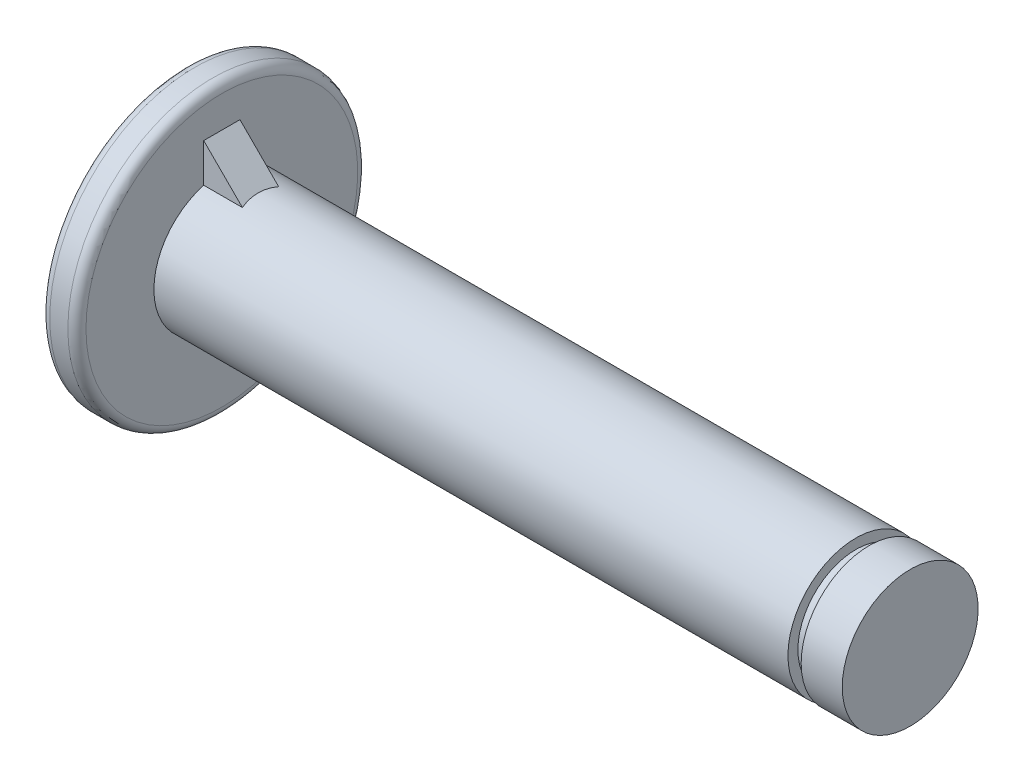
ISO-10303-21;
HEADER;
FILE_DESCRIPTION(('STEP AP214'),'2;1');
FILE_NAME('part.step','',(''),(''),'','','');
FILE_SCHEMA(('AUTOMOTIVE_DESIGN { 1 0 10303 214 1 1 1 1 }'));
ENDSEC;
DATA;
#1=APPLICATION_CONTEXT('core data for automotive mechanical design processes');
#2=APPLICATION_PROTOCOL_DEFINITION('international standard','automotive_design',2000,#1);
#3=PRODUCT_CONTEXT('',#1,'mechanical');
#4=PRODUCT('Part','Part','',(#3));
#5=PRODUCT_RELATED_PRODUCT_CATEGORY('part','',(#4));
#6=PRODUCT_DEFINITION_FORMATION('','',#4);
#7=PRODUCT_DEFINITION_CONTEXT('part definition',#1,'design');
#8=PRODUCT_DEFINITION('design','',#6,#7);
#9=PRODUCT_DEFINITION_SHAPE('','',#8);
#10=(LENGTH_UNIT() NAMED_UNIT(*) SI_UNIT(.MILLI.,.METRE.));
#11=(NAMED_UNIT(*) PLANE_ANGLE_UNIT() SI_UNIT($,.RADIAN.));
#12=(NAMED_UNIT(*) SI_UNIT($,.STERADIAN.) SOLID_ANGLE_UNIT());
#13=UNCERTAINTY_MEASURE_WITH_UNIT(LENGTH_MEASURE(1.E-05),#10,'distance_accuracy_value','');
#14=(GEOMETRIC_REPRESENTATION_CONTEXT(3) GLOBAL_UNCERTAINTY_ASSIGNED_CONTEXT((#13)) GLOBAL_UNIT_ASSIGNED_CONTEXT((#10,
#11,#12)) REPRESENTATION_CONTEXT('',''));
#15=CARTESIAN_POINT('',(0.,0.,0.));
#16=DIRECTION('',(0.,0.,1.));
#17=DIRECTION('',(1.,0.,0.));
#18=AXIS2_PLACEMENT_3D('',#15,#16,#17);
#19=CARTESIAN_POINT('',(0.,0.,0.));
#20=DIRECTION('',(-1.,0.,0.));
#21=DIRECTION('',(0.,0.,1.));
#22=AXIS2_PLACEMENT_3D('',#19,#20,#21);
#23=CYLINDRICAL_SURFACE('',#22,8.);
#24=CARTESIAN_POINT('',(1.5,0.,0.));
#25=DIRECTION('',(-1.,0.,0.));
#26=DIRECTION('',(0.,0.,1.));
#27=AXIS2_PLACEMENT_3D('',#24,#25,#26);
#28=CIRCLE('',#27,8.);
#29=CARTESIAN_POINT('',(1.5,0.,8.));
#30=VERTEX_POINT('',#29);
#31=EDGE_CURVE('E124',#30,#30,#28,.T.);
#32=ORIENTED_EDGE('',*,*,#31,.T.);
#33=EDGE_LOOP('',(#32));
#34=FACE_BOUND('',#33,.T.);
#35=CARTESIAN_POINT('',(0.5,0.,0.));
#36=DIRECTION('',(1.,0.,0.));
#37=DIRECTION('',(0.,0.,-1.));
#38=AXIS2_PLACEMENT_3D('',#35,#36,#37);
#39=CIRCLE('',#38,8.);
#40=CARTESIAN_POINT('',(0.5,0.,-8.));
#41=VERTEX_POINT('',#40);
#42=EDGE_CURVE('E121',#41,#41,#39,.T.);
#43=ORIENTED_EDGE('',*,*,#42,.T.);
#44=EDGE_LOOP('',(#43));
#45=FACE_BOUND('',#44,.T.);
#46=ADVANCED_FACE('F43',(#34,#45),#23,.T.);
#47=CARTESIAN_POINT('',(0.,8.,0.));
#48=DIRECTION('',(1.,0.,0.));
#49=DIRECTION('',(0.,0.,-1.));
#50=AXIS2_PLACEMENT_3D('',#47,#48,#49);
#51=PLANE('',#50);
#52=CARTESIAN_POINT('',(0.,0.,0.));
#53=DIRECTION('',(1.,0.,0.));
#54=DIRECTION('',(0.,0.,-1.));
#55=AXIS2_PLACEMENT_3D('',#52,#53,#54);
#56=CIRCLE('',#55,7.5);
#57=CARTESIAN_POINT('',(0.,0.,-7.5));
#58=VERTEX_POINT('',#57);
#59=EDGE_CURVE('E11',#58,#58,#56,.F.);
#60=ORIENTED_EDGE('',*,*,#59,.T.);
#61=EDGE_LOOP('',(#60));
#62=FACE_BOUND('',#61,.T.);
#63=ADVANCED_FACE('F142',(#62),#51,.F.);
#64=CARTESIAN_POINT('',(40.,0.,0.));
#65=DIRECTION('',(-1.,0.,0.));
#66=DIRECTION('',(0.,0.,1.));
#67=AXIS2_PLACEMENT_3D('',#64,#65,#66);
#68=PLANE('',#67);
#69=CARTESIAN_POINT('',(40.,0.,0.));
#70=DIRECTION('',(-1.,0.,0.));
#71=DIRECTION('',(0.,0.,1.));
#72=AXIS2_PLACEMENT_3D('',#69,#70,#71);
#73=CIRCLE('',#72,3.75);
#74=CARTESIAN_POINT('',(40.,0.,3.75));
#75=VERTEX_POINT('',#74);
#76=EDGE_CURVE('E118',#75,#75,#73,.T.);
#77=ORIENTED_EDGE('',*,*,#76,.F.);
#78=EDGE_LOOP('',(#77));
#79=FACE_BOUND('',#78,.T.);
#80=ADVANCED_FACE('F148',(#79),#68,.F.);
#81=CARTESIAN_POINT('',(0.,0.,0.));
#82=DIRECTION('',(-1.,0.,0.));
#83=DIRECTION('',(0.,0.,1.));
#84=AXIS2_PLACEMENT_3D('',#81,#82,#83);
#85=CYLINDRICAL_SURFACE('',#84,3.75);
#86=CARTESIAN_POINT('',(37.73,0.,0.));
#87=DIRECTION('',(-1.,0.,0.));
#88=DIRECTION('',(0.,0.,1.));
#89=AXIS2_PLACEMENT_3D('',#86,#87,#88);
#90=CIRCLE('',#89,3.75);
#91=CARTESIAN_POINT('',(37.73,0.,3.75));
#92=VERTEX_POINT('',#91);
#93=EDGE_CURVE('E115',#92,#92,#90,.T.);
#94=ORIENTED_EDGE('',*,*,#93,.F.);
#95=EDGE_LOOP('',(#94));
#96=FACE_BOUND('',#95,.T.);
#97=ORIENTED_EDGE('',*,*,#76,.T.);
#98=EDGE_LOOP('',(#97));
#99=FACE_BOUND('',#98,.T.);
#100=ADVANCED_FACE('F155',(#96,#99),#85,.T.);
#101=CARTESIAN_POINT('',(37.73,3.2,0.));
#102=DIRECTION('',(1.,0.,0.));
#103=DIRECTION('',(0.,0.,-1.));
#104=AXIS2_PLACEMENT_3D('',#101,#102,#103);
#105=PLANE('',#104);
#106=CARTESIAN_POINT('',(37.73,0.,0.));
#107=DIRECTION('',(-1.,0.,0.));
#108=DIRECTION('',(0.,0.,1.));
#109=AXIS2_PLACEMENT_3D('',#106,#107,#108);
#110=CIRCLE('',#109,3.2);
#111=CARTESIAN_POINT('',(37.73,0.,3.2));
#112=VERTEX_POINT('',#111);
#113=EDGE_CURVE('E112',#112,#112,#110,.T.);
#114=ORIENTED_EDGE('',*,*,#113,.F.);
#115=EDGE_LOOP('',(#114));
#116=FACE_BOUND('',#115,.T.);
#117=ORIENTED_EDGE('',*,*,#93,.T.);
#118=EDGE_LOOP('',(#117));
#119=FACE_BOUND('',#118,.T.);
#120=ADVANCED_FACE('F159',(#116,#119),#105,.F.);
#121=CARTESIAN_POINT('',(0.,0.,0.));
#122=DIRECTION('',(-1.,0.,0.));
#123=DIRECTION('',(0.,0.,1.));
#124=AXIS2_PLACEMENT_3D('',#121,#122,#123);
#125=CYLINDRICAL_SURFACE('',#124,3.2);
#126=CARTESIAN_POINT('',(37.,0.,0.));
#127=DIRECTION('',(-1.,0.,0.));
#128=DIRECTION('',(0.,0.,1.));
#129=AXIS2_PLACEMENT_3D('',#126,#127,#128);
#130=CIRCLE('',#129,3.2);
#131=CARTESIAN_POINT('',(37.,0.,3.2));
#132=VERTEX_POINT('',#131);
#133=EDGE_CURVE('E109',#132,#132,#130,.T.);
#134=ORIENTED_EDGE('',*,*,#133,.F.);
#135=EDGE_LOOP('',(#134));
#136=FACE_BOUND('',#135,.T.);
#137=ORIENTED_EDGE('',*,*,#113,.T.);
#138=EDGE_LOOP('',(#137));
#139=FACE_BOUND('',#138,.T.);
#140=ADVANCED_FACE('F163',(#136,#139),#125,.T.);
#141=CARTESIAN_POINT('',(37.,3.75,0.));
#142=DIRECTION('',(-1.,0.,0.));
#143=DIRECTION('',(0.,0.,1.));
#144=AXIS2_PLACEMENT_3D('',#141,#142,#143);
#145=PLANE('',#144);
#146=CARTESIAN_POINT('',(37.,0.,0.));
#147=DIRECTION('',(-1.,0.,0.));
#148=DIRECTION('',(0.,0.,1.));
#149=AXIS2_PLACEMENT_3D('',#146,#147,#148);
#150=CIRCLE('',#149,3.75);
#151=CARTESIAN_POINT('',(37.,0.,3.75));
#152=VERTEX_POINT('',#151);
#153=EDGE_CURVE('E106',#152,#152,#150,.T.);
#154=ORIENTED_EDGE('',*,*,#153,.F.);
#155=EDGE_LOOP('',(#154));
#156=FACE_BOUND('',#155,.T.);
#157=ORIENTED_EDGE('',*,*,#133,.T.);
#158=EDGE_LOOP('',(#157));
#159=FACE_BOUND('',#158,.T.);
#160=ADVANCED_FACE('F167',(#156,#159),#145,.F.);
#161=CARTESIAN_POINT('',(0.,0.,0.));
#162=DIRECTION('',(-1.,0.,0.));
#163=DIRECTION('',(0.,0.,1.));
#164=AXIS2_PLACEMENT_3D('',#161,#162,#163);
#165=CYLINDRICAL_SURFACE('',#164,3.75);
#166=CARTESIAN_POINT('',(7.74999999999998,0.,0.));
#167=DIRECTION('',(0.707106781186548,0.707106781186547,0.));
#168=DIRECTION('',(-0.707106781186547,0.707106781186548,0.));
#169=AXIS2_PLACEMENT_3D('',#166,#167,#168);
#170=ELLIPSE('',#169,5.3033008588991,3.75);
#171=CARTESIAN_POINT('',(4.13579192629976,3.61420807370024,-1.));
#172=VERTEX_POINT('',#171);
#173=CARTESIAN_POINT('',(4.13579192629976,3.61420807370024,1.));
#174=VERTEX_POINT('',#173);
#175=EDGE_CURVE('E58',#172,#174,#170,.T.);
#176=ORIENTED_EDGE('',*,*,#175,.T.);
#177=DIRECTION('',(-1.,0.,0.));
#178=VECTOR('',#177,1.);
#179=CARTESIAN_POINT('',(0.,3.61420807370024,1.));
#180=LINE('',#179,#178);
#181=CARTESIAN_POINT('',(2.,3.61420807370024,1.));
#182=VERTEX_POINT('',#181);
#183=EDGE_CURVE('E88',#174,#182,#180,.T.);
#184=ORIENTED_EDGE('',*,*,#183,.T.);
#185=CARTESIAN_POINT('',(2.,0.,0.));
#186=DIRECTION('',(-1.,0.,0.));
#187=DIRECTION('',(0.,0.,1.));
#188=AXIS2_PLACEMENT_3D('',#185,#186,#187);
#189=CIRCLE('',#188,3.75);
#190=CARTESIAN_POINT('',(2.,3.61420807370024,-1.));
#191=VERTEX_POINT('',#190);
#192=EDGE_CURVE('E104',#191,#182,#189,.T.);
#193=ORIENTED_EDGE('',*,*,#192,.F.);
#194=DIRECTION('',(-1.,0.,0.));
#195=VECTOR('',#194,1.);
#196=CARTESIAN_POINT('',(0.,3.61420807370024,-1.));
#197=LINE('',#196,#195);
#198=EDGE_CURVE('E63',#172,#191,#197,.T.);
#199=ORIENTED_EDGE('',*,*,#198,.F.);
#200=EDGE_LOOP('',(#176,#184,#193,#199));
#201=FACE_BOUND('',#200,.T.);
#202=ORIENTED_EDGE('',*,*,#153,.T.);
#203=EDGE_LOOP('',(#202));
#204=FACE_BOUND('',#203,.T.);
#205=ADVANCED_FACE('F137',(#201,#204),#165,.T.);
#206=CARTESIAN_POINT('',(2.,3.75,0.));
#207=DIRECTION('',(-1.,0.,0.));
#208=DIRECTION('',(0.,0.,1.));
#209=AXIS2_PLACEMENT_3D('',#206,#207,#208);
#210=PLANE('',#209);
#211=ORIENTED_EDGE('',*,*,#192,.T.);
#212=DIRECTION('',(0.,1.,0.));
#213=VECTOR('',#212,1.);
#214=CARTESIAN_POINT('',(2.,3.75,1.));
#215=LINE('',#214,#213);
#216=CARTESIAN_POINT('',(2.,5.75,1.));
#217=VERTEX_POINT('',#216);
#218=EDGE_CURVE('E83',#182,#217,#215,.T.);
#219=ORIENTED_EDGE('',*,*,#218,.T.);
#220=DIRECTION('',(0.,0.,-1.));
#221=VECTOR('',#220,1.);
#222=CARTESIAN_POINT('',(2.,5.75,0.));
#223=LINE('',#222,#221);
#224=CARTESIAN_POINT('',(2.,5.75,-1.));
#225=VERTEX_POINT('',#224);
#226=EDGE_CURVE('E77',#217,#225,#223,.T.);
#227=ORIENTED_EDGE('',*,*,#226,.T.);
#228=DIRECTION('',(0.,1.,0.));
#229=VECTOR('',#228,1.);
#230=CARTESIAN_POINT('',(2.,3.75,-1.));
#231=LINE('',#230,#229);
#232=EDGE_CURVE('E81',#191,#225,#231,.T.);
#233=ORIENTED_EDGE('',*,*,#232,.F.);
#234=EDGE_LOOP('',(#211,#219,#227,#233));
#235=FACE_BOUND('',#234,.T.);
#236=CARTESIAN_POINT('',(2.,0.,0.));
#237=DIRECTION('',(-1.,0.,0.));
#238=DIRECTION('',(0.,0.,1.));
#239=AXIS2_PLACEMENT_3D('',#236,#237,#238);
#240=CIRCLE('',#239,7.5);
#241=CARTESIAN_POINT('',(2.,0.,7.5));
#242=VERTEX_POINT('',#241);
#243=EDGE_CURVE('E51',#242,#242,#240,.F.);
#244=ORIENTED_EDGE('',*,*,#243,.T.);
#245=EDGE_LOOP('',(#244));
#246=FACE_BOUND('',#245,.T.);
#247=ADVANCED_FACE('F79',(#235,#246),#210,.F.);
#248=CARTESIAN_POINT('',(1.5,0.,0.));
#249=DIRECTION('',(-1.,0.,0.));
#250=DIRECTION('',(0.,0.,1.));
#251=AXIS2_PLACEMENT_3D('',#248,#249,#250);
#252=TOROIDAL_SURFACE('',#251,7.5,0.5);
#253=ORIENTED_EDGE('',*,*,#31,.F.);
#254=EDGE_LOOP('',(#253));
#255=FACE_BOUND('',#254,.T.);
#256=ORIENTED_EDGE('',*,*,#243,.F.);
#257=EDGE_LOOP('',(#256));
#258=FACE_BOUND('',#257,.T.);
#259=ADVANCED_FACE('F129',(#255,#258),#252,.T.);
#260=CARTESIAN_POINT('',(0.5,0.,0.));
#261=DIRECTION('',(1.,0.,0.));
#262=DIRECTION('',(0.,0.,-1.));
#263=AXIS2_PLACEMENT_3D('',#260,#261,#262);
#264=TOROIDAL_SURFACE('',#263,7.5,0.5);
#265=ORIENTED_EDGE('',*,*,#59,.F.);
#266=EDGE_LOOP('',(#265));
#267=FACE_BOUND('',#266,.T.);
#268=ORIENTED_EDGE('',*,*,#42,.F.);
#269=EDGE_LOOP('',(#268));
#270=FACE_BOUND('',#269,.T.);
#271=ADVANCED_FACE('F45',(#267,#270),#264,.T.);
#272=CARTESIAN_POINT('',(4.,3.75,0.));
#273=DIRECTION('',(0.707106781186548,0.707106781186547,0.));
#274=DIRECTION('',(-0.707106781186547,0.707106781186548,0.));
#275=AXIS2_PLACEMENT_3D('',#272,#273,#274);
#276=PLANE('',#275);
#277=ORIENTED_EDGE('',*,*,#175,.F.);
#278=DIRECTION('',(-0.707106781186547,0.707106781186548,0.));
#279=VECTOR('',#278,1.);
#280=CARTESIAN_POINT('',(4.,3.75,-1.));
#281=LINE('',#280,#279);
#282=EDGE_CURVE('E93',#172,#225,#281,.T.);
#283=ORIENTED_EDGE('',*,*,#282,.T.);
#284=ORIENTED_EDGE('',*,*,#226,.F.);
#285=DIRECTION('',(-0.707106781186547,0.707106781186548,0.));
#286=VECTOR('',#285,1.);
#287=CARTESIAN_POINT('',(4.,3.75,1.));
#288=LINE('',#287,#286);
#289=EDGE_CURVE('E94',#174,#217,#288,.T.);
#290=ORIENTED_EDGE('',*,*,#289,.F.);
#291=EDGE_LOOP('',(#277,#283,#284,#290));
#292=FACE_BOUND('',#291,.T.);
#293=ADVANCED_FACE('F96',(#292),#276,.T.);
#294=CARTESIAN_POINT('',(20.,0.,1.));
#295=DIRECTION('',(0.,0.,1.));
#296=DIRECTION('',(1.,0.,0.));
#297=AXIS2_PLACEMENT_3D('',#294,#295,#296);
#298=PLANE('',#297);
#299=ORIENTED_EDGE('',*,*,#289,.T.);
#300=ORIENTED_EDGE('',*,*,#218,.F.);
#301=ORIENTED_EDGE('',*,*,#183,.F.);
#302=EDGE_LOOP('',(#299,#300,#301));
#303=FACE_BOUND('',#302,.T.);
#304=ADVANCED_FACE('F175',(#303),#298,.T.);
#305=CARTESIAN_POINT('',(20.,0.,-1.));
#306=DIRECTION('',(0.,0.,1.));
#307=DIRECTION('',(1.,0.,0.));
#308=AXIS2_PLACEMENT_3D('',#305,#306,#307);
#309=PLANE('',#308);
#310=ORIENTED_EDGE('',*,*,#282,.F.);
#311=ORIENTED_EDGE('',*,*,#198,.T.);
#312=ORIENTED_EDGE('',*,*,#232,.T.);
#313=EDGE_LOOP('',(#310,#311,#312));
#314=FACE_BOUND('',#313,.T.);
#315=ADVANCED_FACE('F92',(#314),#309,.F.);
#316=CLOSED_SHELL('',(#46,#63,#80,#100,#120,#140,#160,#205,#247,#259,#271,#293,#304,#315));
#317=MANIFOLD_SOLID_BREP('B2',#316);
#318=ADVANCED_BREP_SHAPE_REPRESENTATION('',(#18,#317),#14);
#319=SHAPE_DEFINITION_REPRESENTATION(#9,#318);
ENDSEC;
END-ISO-10303-21;
